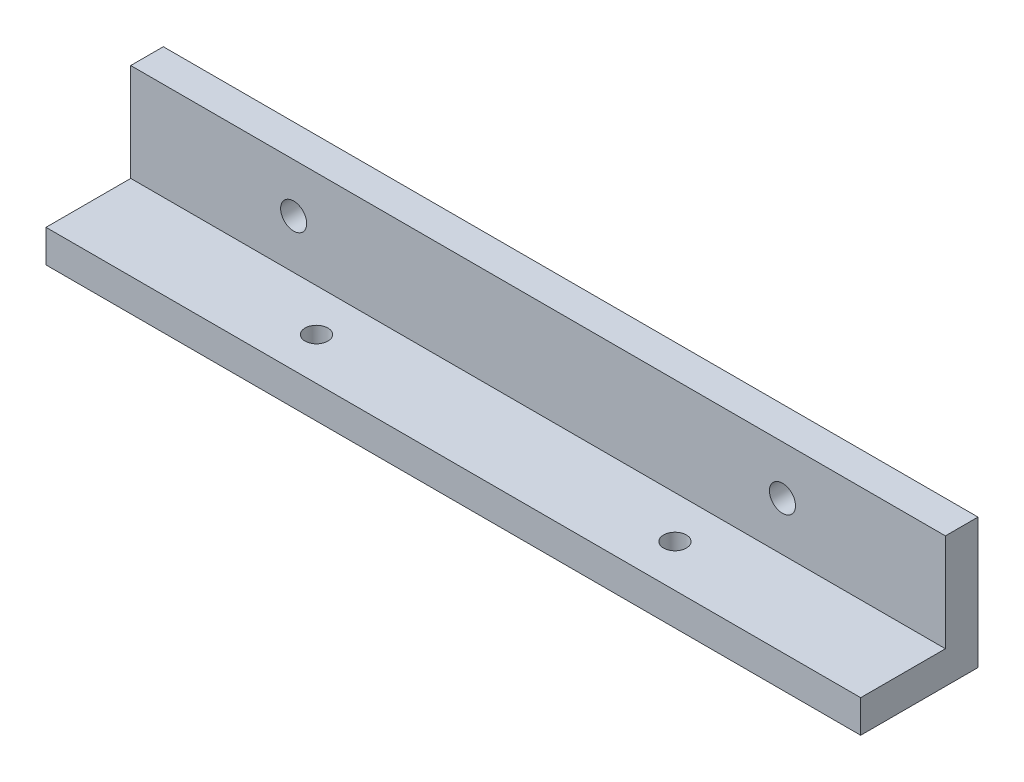
ISO-10303-21;
HEADER;
FILE_DESCRIPTION(('STEP AP214'),'2;1');
FILE_NAME('part.step','',(''),(''),'','','');
FILE_SCHEMA(('AUTOMOTIVE_DESIGN { 1 0 10303 214 1 1 1 1 }'));
ENDSEC;
DATA;
#1=APPLICATION_CONTEXT('core data for automotive mechanical design processes');
#2=APPLICATION_PROTOCOL_DEFINITION('international standard','automotive_design',2000,#1);
#3=PRODUCT_CONTEXT('',#1,'mechanical');
#4=PRODUCT('Part','Part','',(#3));
#5=PRODUCT_RELATED_PRODUCT_CATEGORY('part','',(#4));
#6=PRODUCT_DEFINITION_FORMATION('','',#4);
#7=PRODUCT_DEFINITION_CONTEXT('part definition',#1,'design');
#8=PRODUCT_DEFINITION('design','',#6,#7);
#9=PRODUCT_DEFINITION_SHAPE('','',#8);
#10=(LENGTH_UNIT() NAMED_UNIT(*) SI_UNIT(.MILLI.,.METRE.));
#11=(NAMED_UNIT(*) PLANE_ANGLE_UNIT() SI_UNIT($,.RADIAN.));
#12=(NAMED_UNIT(*) SI_UNIT($,.STERADIAN.) SOLID_ANGLE_UNIT());
#13=UNCERTAINTY_MEASURE_WITH_UNIT(LENGTH_MEASURE(1.E-05),#10,'distance_accuracy_value','');
#14=(GEOMETRIC_REPRESENTATION_CONTEXT(3) GLOBAL_UNCERTAINTY_ASSIGNED_CONTEXT((#13)) GLOBAL_UNIT_ASSIGNED_CONTEXT((#10,
#11,#12)) REPRESENTATION_CONTEXT('',''));
#15=CARTESIAN_POINT('',(0.,0.,0.));
#16=DIRECTION('',(0.,0.,1.));
#17=DIRECTION('',(1.,0.,0.));
#18=AXIS2_PLACEMENT_3D('',#15,#16,#17);
#19=CARTESIAN_POINT('',(0.,0.,0.));
#20=DIRECTION('',(0.,-1.,0.));
#21=DIRECTION('',(0.,0.,-1.));
#22=AXIS2_PLACEMENT_3D('',#19,#20,#21);
#23=PLANE('',#22);
#24=CARTESIAN_POINT('',(35.,0.,-6.5));
#25=DIRECTION('',(0.,1.,0.));
#26=DIRECTION('',(0.,0.,1.));
#27=AXIS2_PLACEMENT_3D('',#24,#25,#26);
#28=CIRCLE('',#27,1.75);
#29=CARTESIAN_POINT('',(35.,0.,-4.75));
#30=VERTEX_POINT('',#29);
#31=EDGE_CURVE('E164',#30,#30,#28,.T.);
#32=ORIENTED_EDGE('',*,*,#31,.F.);
#33=EDGE_LOOP('',(#32));
#34=FACE_BOUND('',#33,.T.);
#35=CARTESIAN_POINT('',(90.,0.,-6.5));
#36=DIRECTION('',(0.,1.,0.));
#37=DIRECTION('',(0.,0.,1.));
#38=AXIS2_PLACEMENT_3D('',#35,#36,#37);
#39=CIRCLE('',#38,1.75);
#40=CARTESIAN_POINT('',(90.,0.,-4.75));
#41=VERTEX_POINT('',#40);
#42=EDGE_CURVE('E158',#41,#41,#39,.T.);
#43=ORIENTED_EDGE('',*,*,#42,.F.);
#44=EDGE_LOOP('',(#43));
#45=FACE_BOUND('',#44,.T.);
#46=DIRECTION('',(1.,0.,0.));
#47=VECTOR('',#46,1.);
#48=CARTESIAN_POINT('',(0.,0.,-13.));
#49=LINE('',#48,#47);
#50=CARTESIAN_POINT('',(0.,0.,-13.));
#51=VERTEX_POINT('',#50);
#52=CARTESIAN_POINT('',(125.,0.,-13.));
#53=VERTEX_POINT('',#52);
#54=EDGE_CURVE('E56',#51,#53,#49,.T.);
#55=ORIENTED_EDGE('',*,*,#54,.F.);
#56=DIRECTION('',(0.,0.,1.));
#57=VECTOR('',#56,1.);
#58=CARTESIAN_POINT('',(0.,0.,0.));
#59=LINE('',#58,#57);
#60=CARTESIAN_POINT('',(0.,0.,0.));
#61=VERTEX_POINT('',#60);
#62=EDGE_CURVE('E118',#51,#61,#59,.T.);
#63=ORIENTED_EDGE('',*,*,#62,.T.);
#64=DIRECTION('',(1.,0.,0.));
#65=VECTOR('',#64,1.);
#66=CARTESIAN_POINT('',(0.,0.,0.));
#67=LINE('',#66,#65);
#68=CARTESIAN_POINT('',(125.,0.,0.));
#69=VERTEX_POINT('',#68);
#70=EDGE_CURVE('E120',#61,#69,#67,.T.);
#71=ORIENTED_EDGE('',*,*,#70,.T.);
#72=DIRECTION('',(0.,0.,-1.));
#73=VECTOR('',#72,1.);
#74=CARTESIAN_POINT('',(125.,0.,0.));
#75=LINE('',#74,#73);
#76=EDGE_CURVE('E128',#69,#53,#75,.T.);
#77=ORIENTED_EDGE('',*,*,#76,.T.);
#78=EDGE_LOOP('',(#55,#63,#71,#77));
#79=FACE_BOUND('',#78,.T.);
#80=ADVANCED_FACE('F39',(#34,#45,#79),#23,.F.);
#81=CARTESIAN_POINT('',(0.,-5.,0.));
#82=DIRECTION('',(-1.,0.,0.));
#83=DIRECTION('',(0.,0.,1.));
#84=AXIS2_PLACEMENT_3D('',#81,#82,#83);
#85=PLANE('',#84);
#86=ORIENTED_EDGE('',*,*,#62,.F.);
#87=DIRECTION('',(0.,-1.,0.));
#88=VECTOR('',#87,1.);
#89=CARTESIAN_POINT('',(0.,15.,-13.));
#90=LINE('',#89,#88);
#91=CARTESIAN_POINT('',(0.,15.,-13.));
#92=VERTEX_POINT('',#91);
#93=EDGE_CURVE('E104',#92,#51,#90,.T.);
#94=ORIENTED_EDGE('',*,*,#93,.F.);
#95=DIRECTION('',(0.,0.,1.));
#96=VECTOR('',#95,1.);
#97=CARTESIAN_POINT('',(0.,15.,-18.));
#98=LINE('',#97,#96);
#99=CARTESIAN_POINT('',(0.,15.,-18.));
#100=VERTEX_POINT('',#99);
#101=EDGE_CURVE('E111',#100,#92,#98,.T.);
#102=ORIENTED_EDGE('',*,*,#101,.F.);
#103=DIRECTION('',(0.,1.,0.));
#104=VECTOR('',#103,1.);
#105=CARTESIAN_POINT('',(0.,-5.,-18.));
#106=LINE('',#105,#104);
#107=CARTESIAN_POINT('',(0.,-5.,-18.));
#108=VERTEX_POINT('',#107);
#109=EDGE_CURVE('E11',#108,#100,#106,.T.);
#110=ORIENTED_EDGE('',*,*,#109,.F.);
#111=DIRECTION('',(0.,0.,1.));
#112=VECTOR('',#111,1.);
#113=CARTESIAN_POINT('',(0.,-5.,0.));
#114=LINE('',#113,#112);
#115=CARTESIAN_POINT('',(0.,-5.,0.));
#116=VERTEX_POINT('',#115);
#117=EDGE_CURVE('E125',#108,#116,#114,.T.);
#118=ORIENTED_EDGE('',*,*,#117,.T.);
#119=DIRECTION('',(0.,1.,0.));
#120=VECTOR('',#119,1.);
#121=CARTESIAN_POINT('',(0.,-5.,0.));
#122=LINE('',#121,#120);
#123=EDGE_CURVE('E43',#116,#61,#122,.T.);
#124=ORIENTED_EDGE('',*,*,#123,.T.);
#125=EDGE_LOOP('',(#86,#94,#102,#110,#118,#124));
#126=FACE_BOUND('',#125,.T.);
#127=ADVANCED_FACE('F41',(#126),#85,.T.);
#128=CARTESIAN_POINT('',(0.,-5.,-18.));
#129=DIRECTION('',(0.,0.,-1.));
#130=DIRECTION('',(-1.,0.,0.));
#131=AXIS2_PLACEMENT_3D('',#128,#129,#130);
#132=PLANE('',#131);
#133=CARTESIAN_POINT('',(25.,7.5,-18.));
#134=DIRECTION('',(0.,0.,1.));
#135=DIRECTION('',(1.,0.,0.));
#136=AXIS2_PLACEMENT_3D('',#133,#134,#135);
#137=CIRCLE('',#136,2.);
#138=CARTESIAN_POINT('',(27.,7.5,-18.));
#139=VERTEX_POINT('',#138);
#140=EDGE_CURVE('E141',#139,#139,#137,.T.);
#141=ORIENTED_EDGE('',*,*,#140,.T.);
#142=EDGE_LOOP('',(#141));
#143=FACE_BOUND('',#142,.T.);
#144=CARTESIAN_POINT('',(100.,7.5,-18.));
#145=DIRECTION('',(0.,0.,1.));
#146=DIRECTION('',(1.,0.,0.));
#147=AXIS2_PLACEMENT_3D('',#144,#145,#146);
#148=CIRCLE('',#147,2.);
#149=CARTESIAN_POINT('',(102.,7.5,-18.));
#150=VERTEX_POINT('',#149);
#151=EDGE_CURVE('E149',#150,#150,#148,.T.);
#152=ORIENTED_EDGE('',*,*,#151,.T.);
#153=EDGE_LOOP('',(#152));
#154=FACE_BOUND('',#153,.T.);
#155=ORIENTED_EDGE('',*,*,#109,.T.);
#156=DIRECTION('',(-1.,0.,0.));
#157=VECTOR('',#156,1.);
#158=CARTESIAN_POINT('',(0.,15.,-18.));
#159=LINE('',#158,#157);
#160=CARTESIAN_POINT('',(125.,15.,-18.));
#161=VERTEX_POINT('',#160);
#162=EDGE_CURVE('E116',#161,#100,#159,.T.);
#163=ORIENTED_EDGE('',*,*,#162,.F.);
#164=DIRECTION('',(0.,1.,0.));
#165=VECTOR('',#164,1.);
#166=CARTESIAN_POINT('',(125.,-5.,-18.));
#167=LINE('',#166,#165);
#168=CARTESIAN_POINT('',(125.,-5.,-18.));
#169=VERTEX_POINT('',#168);
#170=EDGE_CURVE('E48',#169,#161,#167,.T.);
#171=ORIENTED_EDGE('',*,*,#170,.F.);
#172=DIRECTION('',(-1.,0.,0.));
#173=VECTOR('',#172,1.);
#174=CARTESIAN_POINT('',(0.,-5.,-18.));
#175=LINE('',#174,#173);
#176=EDGE_CURVE('E133',#169,#108,#175,.T.);
#177=ORIENTED_EDGE('',*,*,#176,.T.);
#178=EDGE_LOOP('',(#155,#163,#171,#177));
#179=FACE_BOUND('',#178,.T.);
#180=ADVANCED_FACE('F207',(#143,#154,#179),#132,.T.);
#181=CARTESIAN_POINT('',(125.,-5.,0.));
#182=DIRECTION('',(1.,0.,0.));
#183=DIRECTION('',(0.,0.,-1.));
#184=AXIS2_PLACEMENT_3D('',#181,#182,#183);
#185=PLANE('',#184);
#186=ORIENTED_EDGE('',*,*,#76,.F.);
#187=DIRECTION('',(0.,1.,0.));
#188=VECTOR('',#187,1.);
#189=CARTESIAN_POINT('',(125.,-5.,0.));
#190=LINE('',#189,#188);
#191=CARTESIAN_POINT('',(125.,-5.,0.));
#192=VERTEX_POINT('',#191);
#193=EDGE_CURVE('E79',#192,#69,#190,.T.);
#194=ORIENTED_EDGE('',*,*,#193,.F.);
#195=DIRECTION('',(0.,0.,-1.));
#196=VECTOR('',#195,1.);
#197=CARTESIAN_POINT('',(125.,-5.,0.));
#198=LINE('',#197,#196);
#199=EDGE_CURVE('E130',#192,#169,#198,.T.);
#200=ORIENTED_EDGE('',*,*,#199,.T.);
#201=ORIENTED_EDGE('',*,*,#170,.T.);
#202=DIRECTION('',(0.,0.,-1.));
#203=VECTOR('',#202,1.);
#204=CARTESIAN_POINT('',(125.,15.,-18.));
#205=LINE('',#204,#203);
#206=CARTESIAN_POINT('',(125.,15.,-13.));
#207=VERTEX_POINT('',#206);
#208=EDGE_CURVE('E110',#207,#161,#205,.T.);
#209=ORIENTED_EDGE('',*,*,#208,.F.);
#210=DIRECTION('',(0.,-1.,0.));
#211=VECTOR('',#210,1.);
#212=CARTESIAN_POINT('',(125.,15.,-13.));
#213=LINE('',#212,#211);
#214=EDGE_CURVE('E106',#207,#53,#213,.T.);
#215=ORIENTED_EDGE('',*,*,#214,.T.);
#216=EDGE_LOOP('',(#186,#194,#200,#201,#209,#215));
#217=FACE_BOUND('',#216,.T.);
#218=ADVANCED_FACE('F142',(#217),#185,.T.);
#219=CARTESIAN_POINT('',(0.,-5.,0.));
#220=DIRECTION('',(0.,0.,1.));
#221=DIRECTION('',(1.,0.,0.));
#222=AXIS2_PLACEMENT_3D('',#219,#220,#221);
#223=PLANE('',#222);
#224=ORIENTED_EDGE('',*,*,#70,.F.);
#225=ORIENTED_EDGE('',*,*,#123,.F.);
#226=DIRECTION('',(1.,0.,0.));
#227=VECTOR('',#226,1.);
#228=CARTESIAN_POINT('',(0.,-5.,0.));
#229=LINE('',#228,#227);
#230=EDGE_CURVE('E127',#116,#192,#229,.T.);
#231=ORIENTED_EDGE('',*,*,#230,.T.);
#232=ORIENTED_EDGE('',*,*,#193,.T.);
#233=EDGE_LOOP('',(#224,#225,#231,#232));
#234=FACE_BOUND('',#233,.T.);
#235=ADVANCED_FACE('F139',(#234),#223,.T.);
#236=CARTESIAN_POINT('',(0.,-5.,0.));
#237=DIRECTION('',(0.,-1.,0.));
#238=DIRECTION('',(0.,0.,-1.));
#239=AXIS2_PLACEMENT_3D('',#236,#237,#238);
#240=PLANE('',#239);
#241=CARTESIAN_POINT('',(35.,-5.,-6.5));
#242=DIRECTION('',(0.,1.,0.));
#243=DIRECTION('',(0.,0.,1.));
#244=AXIS2_PLACEMENT_3D('',#241,#242,#243);
#245=CIRCLE('',#244,1.75);
#246=CARTESIAN_POINT('',(35.,-5.,-4.75));
#247=VERTEX_POINT('',#246);
#248=EDGE_CURVE('E150',#247,#247,#245,.T.);
#249=ORIENTED_EDGE('',*,*,#248,.T.);
#250=EDGE_LOOP('',(#249));
#251=FACE_BOUND('',#250,.T.);
#252=CARTESIAN_POINT('',(90.,-5.,-6.5));
#253=DIRECTION('',(0.,1.,0.));
#254=DIRECTION('',(0.,0.,1.));
#255=AXIS2_PLACEMENT_3D('',#252,#253,#254);
#256=CIRCLE('',#255,1.75);
#257=CARTESIAN_POINT('',(90.,-5.,-4.75));
#258=VERTEX_POINT('',#257);
#259=EDGE_CURVE('E161',#258,#258,#256,.T.);
#260=ORIENTED_EDGE('',*,*,#259,.T.);
#261=EDGE_LOOP('',(#260));
#262=FACE_BOUND('',#261,.T.);
#263=ORIENTED_EDGE('',*,*,#117,.F.);
#264=ORIENTED_EDGE('',*,*,#176,.F.);
#265=ORIENTED_EDGE('',*,*,#199,.F.);
#266=ORIENTED_EDGE('',*,*,#230,.F.);
#267=EDGE_LOOP('',(#263,#264,#265,#266));
#268=FACE_BOUND('',#267,.T.);
#269=ADVANCED_FACE('F170',(#251,#262,#268),#240,.T.);
#270=CARTESIAN_POINT('',(0.,15.,-13.));
#271=DIRECTION('',(0.,0.,-1.));
#272=DIRECTION('',(-1.,0.,0.));
#273=AXIS2_PLACEMENT_3D('',#270,#271,#272);
#274=PLANE('',#273);
#275=CARTESIAN_POINT('',(25.,7.5,-13.));
#276=DIRECTION('',(0.,0.,1.));
#277=DIRECTION('',(1.,0.,0.));
#278=AXIS2_PLACEMENT_3D('',#275,#276,#277);
#279=CIRCLE('',#278,2.);
#280=CARTESIAN_POINT('',(27.,7.5,-13.));
#281=VERTEX_POINT('',#280);
#282=EDGE_CURVE('E153',#281,#281,#279,.T.);
#283=ORIENTED_EDGE('',*,*,#282,.F.);
#284=EDGE_LOOP('',(#283));
#285=FACE_BOUND('',#284,.T.);
#286=CARTESIAN_POINT('',(100.,7.5,-13.));
#287=DIRECTION('',(0.,0.,1.));
#288=DIRECTION('',(1.,0.,0.));
#289=AXIS2_PLACEMENT_3D('',#286,#287,#288);
#290=CIRCLE('',#289,2.);
#291=CARTESIAN_POINT('',(102.,7.5,-13.));
#292=VERTEX_POINT('',#291);
#293=EDGE_CURVE('E146',#292,#292,#290,.T.);
#294=ORIENTED_EDGE('',*,*,#293,.F.);
#295=EDGE_LOOP('',(#294));
#296=FACE_BOUND('',#295,.T.);
#297=ORIENTED_EDGE('',*,*,#54,.T.);
#298=ORIENTED_EDGE('',*,*,#214,.F.);
#299=DIRECTION('',(1.,0.,0.));
#300=VECTOR('',#299,1.);
#301=CARTESIAN_POINT('',(0.,15.,-13.));
#302=LINE('',#301,#300);
#303=EDGE_CURVE('E100',#92,#207,#302,.T.);
#304=ORIENTED_EDGE('',*,*,#303,.F.);
#305=ORIENTED_EDGE('',*,*,#93,.T.);
#306=EDGE_LOOP('',(#297,#298,#304,#305));
#307=FACE_BOUND('',#306,.T.);
#308=ADVANCED_FACE('F102',(#285,#296,#307),#274,.F.);
#309=CARTESIAN_POINT('',(0.,15.,0.));
#310=DIRECTION('',(0.,1.,0.));
#311=DIRECTION('',(0.,0.,1.));
#312=AXIS2_PLACEMENT_3D('',#309,#310,#311);
#313=PLANE('',#312);
#314=ORIENTED_EDGE('',*,*,#101,.T.);
#315=ORIENTED_EDGE('',*,*,#303,.T.);
#316=ORIENTED_EDGE('',*,*,#208,.T.);
#317=ORIENTED_EDGE('',*,*,#162,.T.);
#318=EDGE_LOOP('',(#314,#315,#316,#317));
#319=FACE_BOUND('',#318,.T.);
#320=ADVANCED_FACE('F114',(#319),#313,.T.);
#321=CARTESIAN_POINT('',(100.,7.5,-18.));
#322=DIRECTION('',(0.,0.,1.));
#323=DIRECTION('',(1.,0.,0.));
#324=AXIS2_PLACEMENT_3D('',#321,#322,#323);
#325=CYLINDRICAL_SURFACE('',#324,2.);
#326=ORIENTED_EDGE('',*,*,#151,.F.);
#327=EDGE_LOOP('',(#326));
#328=FACE_BOUND('',#327,.T.);
#329=ORIENTED_EDGE('',*,*,#293,.T.);
#330=EDGE_LOOP('',(#329));
#331=FACE_BOUND('',#330,.T.);
#332=ADVANCED_FACE('F192',(#328,#331),#325,.F.);
#333=CARTESIAN_POINT('',(25.,7.5,-18.));
#334=DIRECTION('',(0.,0.,1.));
#335=DIRECTION('',(1.,0.,0.));
#336=AXIS2_PLACEMENT_3D('',#333,#334,#335);
#337=CYLINDRICAL_SURFACE('',#336,2.);
#338=ORIENTED_EDGE('',*,*,#140,.F.);
#339=EDGE_LOOP('',(#338));
#340=FACE_BOUND('',#339,.T.);
#341=ORIENTED_EDGE('',*,*,#282,.T.);
#342=EDGE_LOOP('',(#341));
#343=FACE_BOUND('',#342,.T.);
#344=ADVANCED_FACE('F186',(#340,#343),#337,.F.);
#345=CARTESIAN_POINT('',(90.,-5.,-6.5));
#346=DIRECTION('',(0.,1.,0.));
#347=DIRECTION('',(0.,0.,1.));
#348=AXIS2_PLACEMENT_3D('',#345,#346,#347);
#349=CYLINDRICAL_SURFACE('',#348,1.75);
#350=ORIENTED_EDGE('',*,*,#259,.F.);
#351=EDGE_LOOP('',(#350));
#352=FACE_BOUND('',#351,.T.);
#353=ORIENTED_EDGE('',*,*,#42,.T.);
#354=EDGE_LOOP('',(#353));
#355=FACE_BOUND('',#354,.T.);
#356=ADVANCED_FACE('F176',(#352,#355),#349,.F.);
#357=CARTESIAN_POINT('',(35.,-5.,-6.5));
#358=DIRECTION('',(0.,1.,0.));
#359=DIRECTION('',(0.,0.,1.));
#360=AXIS2_PLACEMENT_3D('',#357,#358,#359);
#361=CYLINDRICAL_SURFACE('',#360,1.75);
#362=ORIENTED_EDGE('',*,*,#248,.F.);
#363=EDGE_LOOP('',(#362));
#364=FACE_BOUND('',#363,.T.);
#365=ORIENTED_EDGE('',*,*,#31,.T.);
#366=EDGE_LOOP('',(#365));
#367=FACE_BOUND('',#366,.T.);
#368=ADVANCED_FACE('F173',(#364,#367),#361,.F.);
#369=CLOSED_SHELL('',(#80,#127,#180,#218,#235,#269,#308,#320,#332,#344,#356,#368));
#370=MANIFOLD_SOLID_BREP('B2',#369);
#371=ADVANCED_BREP_SHAPE_REPRESENTATION('',(#18,#370),#14);
#372=SHAPE_DEFINITION_REPRESENTATION(#9,#371);
ENDSEC;
END-ISO-10303-21;
